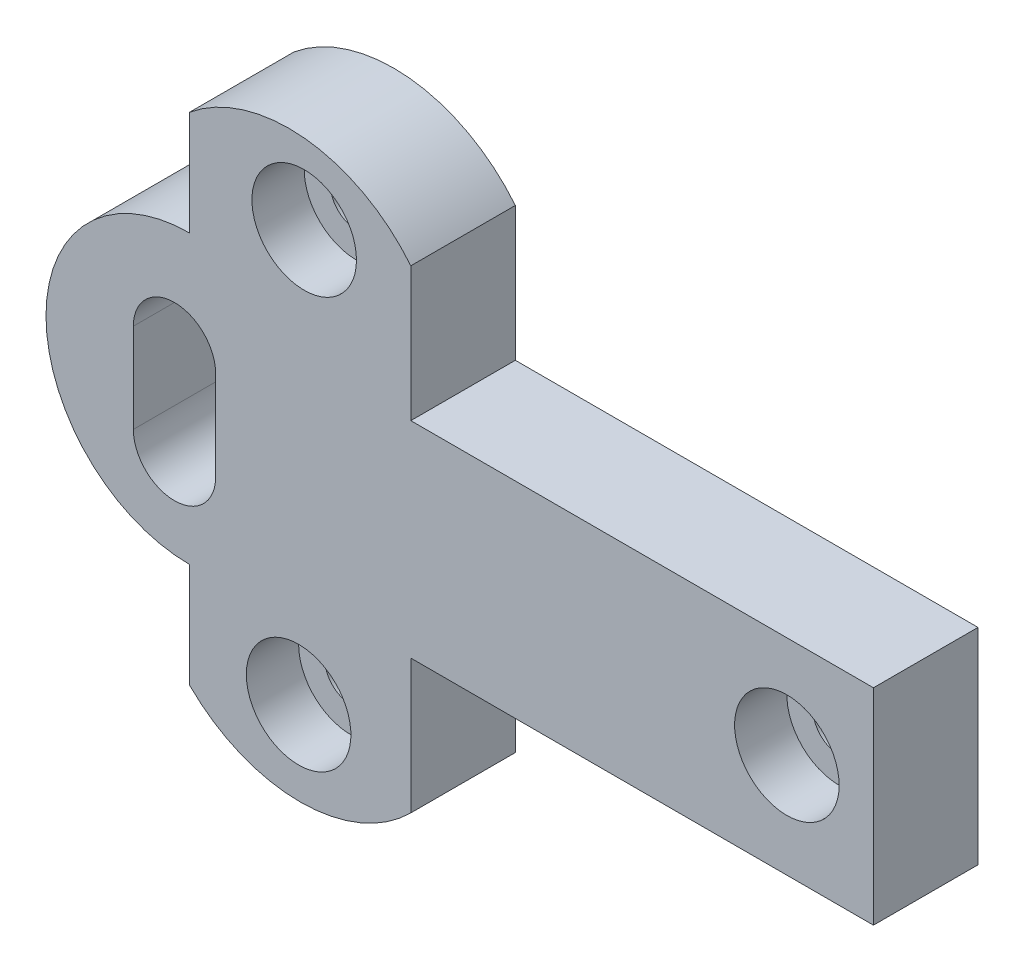
ISO-10303-21;
HEADER;
FILE_DESCRIPTION(('STEP AP214'),'2;1');
FILE_NAME('part.step','',(''),(''),'','','');
FILE_SCHEMA(('AUTOMOTIVE_DESIGN { 1 0 10303 214 1 1 1 1 }'));
ENDSEC;
DATA;
#1=APPLICATION_CONTEXT('core data for automotive mechanical design processes');
#2=APPLICATION_PROTOCOL_DEFINITION('international standard','automotive_design',2000,#1);
#3=PRODUCT_CONTEXT('',#1,'mechanical');
#4=PRODUCT('Part','Part','',(#3));
#5=PRODUCT_RELATED_PRODUCT_CATEGORY('part','',(#4));
#6=PRODUCT_DEFINITION_FORMATION('','',#4);
#7=PRODUCT_DEFINITION_CONTEXT('part definition',#1,'design');
#8=PRODUCT_DEFINITION('design','',#6,#7);
#9=PRODUCT_DEFINITION_SHAPE('','',#8);
#10=(LENGTH_UNIT() NAMED_UNIT(*) SI_UNIT(.MILLI.,.METRE.));
#11=(NAMED_UNIT(*) PLANE_ANGLE_UNIT() SI_UNIT($,.RADIAN.));
#12=(NAMED_UNIT(*) SI_UNIT($,.STERADIAN.) SOLID_ANGLE_UNIT());
#13=UNCERTAINTY_MEASURE_WITH_UNIT(LENGTH_MEASURE(1.E-05),#10,'distance_accuracy_value','');
#14=(GEOMETRIC_REPRESENTATION_CONTEXT(3) GLOBAL_UNCERTAINTY_ASSIGNED_CONTEXT((#13)) GLOBAL_UNIT_ASSIGNED_CONTEXT((#10,
#11,#12)) REPRESENTATION_CONTEXT('',''));
#15=CARTESIAN_POINT('',(0.,0.,0.));
#16=DIRECTION('',(0.,0.,1.));
#17=DIRECTION('',(1.,0.,0.));
#18=AXIS2_PLACEMENT_3D('',#15,#16,#17);
#19=CARTESIAN_POINT('',(-63.4934408824434,-26.2952633957593,20.));
#20=DIRECTION('',(0.,0.,1.));
#21=DIRECTION('',(1.,0.,0.));
#22=AXIS2_PLACEMENT_3D('',#19,#20,#21);
#23=PLANE('',#22);
#24=CARTESIAN_POINT('',(-87.5365630246195,-10.4618676253859,20.));
#25=DIRECTION('',(0.,0.,1.));
#26=DIRECTION('',(1.,0.,0.));
#27=AXIS2_PLACEMENT_3D('',#24,#25,#26);
#28=CIRCLE('',#27,7.87544496243334);
#29=CARTESIAN_POINT('',(-95.4120079870528,-10.4618676253859,20.));
#30=VERTEX_POINT('',#29);
#31=CARTESIAN_POINT('',(-79.6611180621862,-10.4618676253859,20.));
#32=VERTEX_POINT('',#31);
#33=EDGE_CURVE('E54',#30,#32,#28,.T.);
#34=ORIENTED_EDGE('',*,*,#33,.F.);
#35=DIRECTION('',(0.,-1.,0.));
#36=VECTOR('',#35,1.);
#37=CARTESIAN_POINT('',(-95.4120079870528,-10.4618676253859,20.));
#38=LINE('',#37,#36);
#39=CARTESIAN_POINT('',(-95.4120079870528,6.63335664860856,20.));
#40=VERTEX_POINT('',#39);
#41=EDGE_CURVE('E158',#40,#30,#38,.T.);
#42=ORIENTED_EDGE('',*,*,#41,.F.);
#43=CARTESIAN_POINT('',(-87.5365630246195,6.63335664860856,20.));
#44=DIRECTION('',(0.,0.,1.));
#45=DIRECTION('',(1.,0.,0.));
#46=AXIS2_PLACEMENT_3D('',#43,#44,#45);
#47=CIRCLE('',#46,7.87544496243334);
#48=CARTESIAN_POINT('',(-79.6611180621862,6.63335664860856,20.));
#49=VERTEX_POINT('',#48);
#50=EDGE_CURVE('E161',#49,#40,#47,.T.);
#51=ORIENTED_EDGE('',*,*,#50,.F.);
#52=DIRECTION('',(0.,1.,0.));
#53=VECTOR('',#52,1.);
#54=CARTESIAN_POINT('',(-79.6611180621862,-10.4618676253859,20.));
#55=LINE('',#54,#53);
#56=EDGE_CURVE('E170',#32,#49,#55,.T.);
#57=ORIENTED_EDGE('',*,*,#56,.F.);
#58=EDGE_LOOP('',(#34,#42,#51,#57));
#59=FACE_BOUND('',#58,.T.);
#60=CARTESIAN_POINT('',(-63.7943137850185,-40.2511393195703,20.));
#61=DIRECTION('',(0.,0.,-1.));
#62=DIRECTION('',(-1.,0.,0.));
#63=AXIS2_PLACEMENT_3D('',#60,#61,#62);
#64=CIRCLE('',#63,10.);
#65=CARTESIAN_POINT('',(-73.7943137850185,-40.2511393195703,20.));
#66=VERTEX_POINT('',#65);
#67=EDGE_CURVE('E193',#66,#66,#64,.T.);
#68=ORIENTED_EDGE('',*,*,#67,.T.);
#69=EDGE_LOOP('',(#68));
#70=FACE_BOUND('',#69,.T.);
#71=DIRECTION('',(0.,1.,0.));
#72=VECTOR('',#71,1.);
#73=CARTESIAN_POINT('',(46.1770479145043,17.5301755971729,20.));
#74=LINE('',#73,#72);
#75=CARTESIAN_POINT('',(46.1770479145043,-21.8058281818492,20.));
#76=VERTEX_POINT('',#75);
#77=CARTESIAN_POINT('',(46.1770479145043,17.5301755971729,20.));
#78=VERTEX_POINT('',#77);
#79=EDGE_CURVE('E198',#76,#78,#74,.T.);
#80=ORIENTED_EDGE('',*,*,#79,.T.);
#81=DIRECTION('',(-1.,0.,0.));
#82=VECTOR('',#81,1.);
#83=CARTESIAN_POINT('',(46.1770479145043,17.5301755971729,20.));
#84=LINE('',#83,#82);
#85=CARTESIAN_POINT('',(-42.3289605882956,17.5301755971729,20.));
#86=VERTEX_POINT('',#85);
#87=EDGE_CURVE('E201',#78,#86,#84,.T.);
#88=ORIENTED_EDGE('',*,*,#87,.T.);
#89=DIRECTION('',(0.,1.,0.));
#90=VECTOR('',#89,1.);
#91=CARTESIAN_POINT('',(-42.3289605882956,17.5301755971729,20.));
#92=LINE('',#91,#90);
#93=CARTESIAN_POINT('',(-42.3289605882956,43.1840911052309,20.));
#94=VERTEX_POINT('',#93);
#95=EDGE_CURVE('E204',#86,#94,#92,.T.);
#96=ORIENTED_EDGE('',*,*,#95,.T.);
#97=CARTESIAN_POINT('',(-65.6106395340796,24.3736185511406,20.));
#98=DIRECTION('',(0.,0.,1.));
#99=DIRECTION('',(1.,0.,0.));
#100=AXIS2_PLACEMENT_3D('',#97,#98,#99);
#101=CIRCLE('',#100,29.931095072562);
#102=CARTESIAN_POINT('',(-84.660607585696,47.4597435935799,20.));
#103=VERTEX_POINT('',#102);
#104=EDGE_CURVE('E206',#94,#103,#101,.T.);
#105=ORIENTED_EDGE('',*,*,#104,.T.);
#106=DIRECTION('',(0.,-1.,0.));
#107=VECTOR('',#106,1.);
#108=CARTESIAN_POINT('',(-84.660607585696,47.4597435935799,20.));
#109=LINE('',#108,#107);
#110=CARTESIAN_POINT('',(-84.660607585696,27.4597435935799,20.));
#111=VERTEX_POINT('',#110);
#112=EDGE_CURVE('E208',#103,#111,#109,.T.);
#113=ORIENTED_EDGE('',*,*,#112,.T.);
#114=CARTESIAN_POINT('',(-84.6592643811436,-4.81636640289044E-08,20.));
#115=DIRECTION('',(0.,0.,1.));
#116=DIRECTION('',(-1.,0.,0.));
#117=AXIS2_PLACEMENT_3D('',#114,#115,#116);
#118=CIRCLE('',#117,27.4597436745952);
#119=CARTESIAN_POINT('',(-84.6579211765912,-27.4597436899072,20.));
#120=VERTEX_POINT('',#119);
#121=EDGE_CURVE('E210',#111,#120,#118,.T.);
#122=ORIENTED_EDGE('',*,*,#121,.T.);
#123=DIRECTION('',(0.,-1.,0.));
#124=VECTOR('',#123,1.);
#125=CARTESIAN_POINT('',(-84.6579211765912,-47.4597436899072,20.));
#126=LINE('',#125,#124);
#127=CARTESIAN_POINT('',(-84.6579211765912,-47.4597436899072,20.));
#128=VERTEX_POINT('',#127);
#129=EDGE_CURVE('E212',#120,#128,#126,.T.);
#130=ORIENTED_EDGE('',*,*,#129,.T.);
#131=CARTESIAN_POINT('',(-63.4934408824434,-26.2952633957593,20.));
#132=DIRECTION('',(0.,0.,1.));
#133=DIRECTION('',(1.,0.,0.));
#134=AXIS2_PLACEMENT_3D('',#131,#132,#133);
#135=CIRCLE('',#134,29.931095072562);
#136=CARTESIAN_POINT('',(-42.3289605882956,-47.4597436899072,20.));
#137=VERTEX_POINT('',#136);
#138=EDGE_CURVE('E214',#128,#137,#135,.T.);
#139=ORIENTED_EDGE('',*,*,#138,.T.);
#140=DIRECTION('',(0.,1.,0.));
#141=VECTOR('',#140,1.);
#142=CARTESIAN_POINT('',(-42.3289605882956,-47.4597436899072,20.));
#143=LINE('',#142,#141);
#144=CARTESIAN_POINT('',(-42.3289605882956,-21.8058281818492,20.));
#145=VERTEX_POINT('',#144);
#146=EDGE_CURVE('E216',#137,#145,#143,.T.);
#147=ORIENTED_EDGE('',*,*,#146,.T.);
#148=DIRECTION('',(1.,0.,0.));
#149=VECTOR('',#148,1.);
#150=CARTESIAN_POINT('',(-42.3289605882956,-21.8058281818492,20.));
#151=LINE('',#150,#149);
#152=EDGE_CURVE('E218',#145,#76,#151,.T.);
#153=ORIENTED_EDGE('',*,*,#152,.T.);
#154=EDGE_LOOP('',(#80,#88,#96,#105,#113,#122,#130,#139,#147,#153));
#155=FACE_BOUND('',#154,.T.);
#156=CARTESIAN_POINT('',(29.6122655915803,-1.91425548838866,20.));
#157=DIRECTION('',(0.,0.,1.));
#158=DIRECTION('',(1.,0.,0.));
#159=AXIS2_PLACEMENT_3D('',#156,#157,#158);
#160=CIRCLE('',#159,10.);
#161=CARTESIAN_POINT('',(39.6122655915803,-1.91425548838866,20.));
#162=VERTEX_POINT('',#161);
#163=EDGE_CURVE('E187',#162,#162,#160,.T.);
#164=ORIENTED_EDGE('',*,*,#163,.F.);
#165=EDGE_LOOP('',(#164));
#166=FACE_BOUND('',#165,.T.);
#167=CARTESIAN_POINT('',(-62.7256310923718,38.9295759761807,20.));
#168=DIRECTION('',(0.,0.,1.));
#169=DIRECTION('',(1.,0.,0.));
#170=AXIS2_PLACEMENT_3D('',#167,#168,#169);
#171=CIRCLE('',#170,10.);
#172=CARTESIAN_POINT('',(-52.7256310923717,38.9295759761807,20.));
#173=VERTEX_POINT('',#172);
#174=EDGE_CURVE('E184',#173,#173,#171,.T.);
#175=ORIENTED_EDGE('',*,*,#174,.F.);
#176=EDGE_LOOP('',(#175));
#177=FACE_BOUND('',#176,.T.);
#178=ADVANCED_FACE('F37',(#59,#70,#155,#166,#177),#23,.T.);
#179=CARTESIAN_POINT('',(46.1770479145043,17.5301755971729,20.));
#180=DIRECTION('',(-1.,0.,0.));
#181=DIRECTION('',(0.,-1.,0.));
#182=AXIS2_PLACEMENT_3D('',#179,#180,#181);
#183=PLANE('',#182);
#184=DIRECTION('',(0.,1.,0.));
#185=VECTOR('',#184,1.);
#186=CARTESIAN_POINT('',(46.1770479145043,17.5301755971729,0.));
#187=LINE('',#186,#185);
#188=CARTESIAN_POINT('',(46.1770479145043,-21.8058281818492,0.));
#189=VERTEX_POINT('',#188);
#190=CARTESIAN_POINT('',(46.1770479145043,17.5301755971729,0.));
#191=VERTEX_POINT('',#190);
#192=EDGE_CURVE('E183',#189,#191,#187,.T.);
#193=ORIENTED_EDGE('',*,*,#192,.T.);
#194=DIRECTION('',(0.,0.,-1.));
#195=VECTOR('',#194,1.);
#196=CARTESIAN_POINT('',(46.1770479145043,17.5301755971729,20.));
#197=LINE('',#196,#195);
#198=EDGE_CURVE('E11',#78,#191,#197,.T.);
#199=ORIENTED_EDGE('',*,*,#198,.F.);
#200=ORIENTED_EDGE('',*,*,#79,.F.);
#201=DIRECTION('',(0.,0.,-1.));
#202=VECTOR('',#201,1.);
#203=CARTESIAN_POINT('',(46.1770479145043,-21.8058281818492,20.));
#204=LINE('',#203,#202);
#205=EDGE_CURVE('E220',#76,#189,#204,.T.);
#206=ORIENTED_EDGE('',*,*,#205,.T.);
#207=EDGE_LOOP('',(#193,#199,#200,#206));
#208=FACE_BOUND('',#207,.T.);
#209=ADVANCED_FACE('F39',(#208),#183,.F.);
#210=CARTESIAN_POINT('',(46.1770479145043,17.5301755971729,20.));
#211=DIRECTION('',(0.,-1.,0.));
#212=DIRECTION('',(1.,0.,0.));
#213=AXIS2_PLACEMENT_3D('',#210,#211,#212);
#214=PLANE('',#213);
#215=DIRECTION('',(-1.,0.,0.));
#216=VECTOR('',#215,1.);
#217=CARTESIAN_POINT('',(46.1770479145043,17.5301755971729,0.));
#218=LINE('',#217,#216);
#219=CARTESIAN_POINT('',(-42.3289605882956,17.5301755971729,0.));
#220=VERTEX_POINT('',#219);
#221=EDGE_CURVE('E223',#191,#220,#218,.T.);
#222=ORIENTED_EDGE('',*,*,#221,.T.);
#223=DIRECTION('',(0.,0.,-1.));
#224=VECTOR('',#223,1.);
#225=CARTESIAN_POINT('',(-42.3289605882956,17.5301755971729,20.));
#226=LINE('',#225,#224);
#227=EDGE_CURVE('E46',#86,#220,#226,.T.);
#228=ORIENTED_EDGE('',*,*,#227,.F.);
#229=ORIENTED_EDGE('',*,*,#87,.F.);
#230=ORIENTED_EDGE('',*,*,#198,.T.);
#231=EDGE_LOOP('',(#222,#228,#229,#230));
#232=FACE_BOUND('',#231,.T.);
#233=ADVANCED_FACE('F296',(#232),#214,.F.);
#234=CARTESIAN_POINT('',(-42.3289605882956,17.5301755971729,20.));
#235=DIRECTION('',(-1.,0.,0.));
#236=DIRECTION('',(0.,-1.,0.));
#237=AXIS2_PLACEMENT_3D('',#234,#235,#236);
#238=PLANE('',#237);
#239=DIRECTION('',(0.,1.,0.));
#240=VECTOR('',#239,1.);
#241=CARTESIAN_POINT('',(-42.3289605882956,17.5301755971729,0.));
#242=LINE('',#241,#240);
#243=CARTESIAN_POINT('',(-42.3289605882956,43.1840911052309,0.));
#244=VERTEX_POINT('',#243);
#245=EDGE_CURVE('E225',#220,#244,#242,.T.);
#246=ORIENTED_EDGE('',*,*,#245,.T.);
#247=DIRECTION('',(0.,0.,-1.));
#248=VECTOR('',#247,1.);
#249=CARTESIAN_POINT('',(-42.3289605882956,43.1840911052309,20.));
#250=LINE('',#249,#248);
#251=EDGE_CURVE('E260',#94,#244,#250,.T.);
#252=ORIENTED_EDGE('',*,*,#251,.F.);
#253=ORIENTED_EDGE('',*,*,#95,.F.);
#254=ORIENTED_EDGE('',*,*,#227,.T.);
#255=EDGE_LOOP('',(#246,#252,#253,#254));
#256=FACE_BOUND('',#255,.T.);
#257=ADVANCED_FACE('F333',(#256),#238,.F.);
#258=CARTESIAN_POINT('',(-65.6106395340796,24.3736185511406,20.));
#259=DIRECTION('',(0.,0.,-1.));
#260=DIRECTION('',(-1.,0.,0.));
#261=AXIS2_PLACEMENT_3D('',#258,#259,#260);
#262=CYLINDRICAL_SURFACE('',#261,29.931095072562);
#263=CARTESIAN_POINT('',(-65.6106395340796,24.3736185511406,0.));
#264=DIRECTION('',(0.,0.,1.));
#265=DIRECTION('',(1.,0.,0.));
#266=AXIS2_PLACEMENT_3D('',#263,#264,#265);
#267=CIRCLE('',#266,29.931095072562);
#268=CARTESIAN_POINT('',(-84.660607585696,47.4597435935799,0.));
#269=VERTEX_POINT('',#268);
#270=EDGE_CURVE('E227',#244,#269,#267,.T.);
#271=ORIENTED_EDGE('',*,*,#270,.T.);
#272=DIRECTION('',(0.,0.,-1.));
#273=VECTOR('',#272,1.);
#274=CARTESIAN_POINT('',(-84.660607585696,47.4597435935799,20.));
#275=LINE('',#274,#273);
#276=EDGE_CURVE('E257',#103,#269,#275,.T.);
#277=ORIENTED_EDGE('',*,*,#276,.F.);
#278=ORIENTED_EDGE('',*,*,#104,.F.);
#279=ORIENTED_EDGE('',*,*,#251,.T.);
#280=EDGE_LOOP('',(#271,#277,#278,#279));
#281=FACE_BOUND('',#280,.T.);
#282=ADVANCED_FACE('F329',(#281),#262,.T.);
#283=CARTESIAN_POINT('',(-84.660607585696,47.4597435935799,20.));
#284=DIRECTION('',(1.,0.,0.));
#285=DIRECTION('',(0.,0.,-1.));
#286=AXIS2_PLACEMENT_3D('',#283,#284,#285);
#287=PLANE('',#286);
#288=DIRECTION('',(0.,-1.,0.));
#289=VECTOR('',#288,1.);
#290=CARTESIAN_POINT('',(-84.660607585696,47.4597435935799,0.));
#291=LINE('',#290,#289);
#292=CARTESIAN_POINT('',(-84.660607585696,27.4597435935799,0.));
#293=VERTEX_POINT('',#292);
#294=EDGE_CURVE('E229',#269,#293,#291,.T.);
#295=ORIENTED_EDGE('',*,*,#294,.T.);
#296=DIRECTION('',(0.,0.,-1.));
#297=VECTOR('',#296,1.);
#298=CARTESIAN_POINT('',(-84.660607585696,27.4597435935799,20.));
#299=LINE('',#298,#297);
#300=EDGE_CURVE('E254',#111,#293,#299,.T.);
#301=ORIENTED_EDGE('',*,*,#300,.F.);
#302=ORIENTED_EDGE('',*,*,#112,.F.);
#303=ORIENTED_EDGE('',*,*,#276,.T.);
#304=EDGE_LOOP('',(#295,#301,#302,#303));
#305=FACE_BOUND('',#304,.T.);
#306=ADVANCED_FACE('F325',(#305),#287,.F.);
#307=CARTESIAN_POINT('',(-84.6592643811436,-4.81636640289044E-08,20.));
#308=DIRECTION('',(0.,0.,-1.));
#309=DIRECTION('',(-1.,0.,0.));
#310=AXIS2_PLACEMENT_3D('',#307,#308,#309);
#311=CYLINDRICAL_SURFACE('',#310,27.4597436745952);
#312=CARTESIAN_POINT('',(-84.6592643811436,-4.81636640289044E-08,0.));
#313=DIRECTION('',(0.,0.,1.));
#314=DIRECTION('',(-1.,0.,0.));
#315=AXIS2_PLACEMENT_3D('',#312,#313,#314);
#316=CIRCLE('',#315,27.4597436745952);
#317=CARTESIAN_POINT('',(-84.6579211765912,-27.4597436899072,0.));
#318=VERTEX_POINT('',#317);
#319=EDGE_CURVE('E231',#293,#318,#316,.T.);
#320=ORIENTED_EDGE('',*,*,#319,.T.);
#321=DIRECTION('',(0.,0.,-1.));
#322=VECTOR('',#321,1.);
#323=CARTESIAN_POINT('',(-84.6579211765912,-27.4597436899072,20.));
#324=LINE('',#323,#322);
#325=EDGE_CURVE('E251',#120,#318,#324,.T.);
#326=ORIENTED_EDGE('',*,*,#325,.F.);
#327=ORIENTED_EDGE('',*,*,#121,.F.);
#328=ORIENTED_EDGE('',*,*,#300,.T.);
#329=EDGE_LOOP('',(#320,#326,#327,#328));
#330=FACE_BOUND('',#329,.T.);
#331=ADVANCED_FACE('F321',(#330),#311,.T.);
#332=CARTESIAN_POINT('',(-84.6579211765912,-47.4597436899072,20.));
#333=DIRECTION('',(1.,0.,0.));
#334=DIRECTION('',(0.,0.,-1.));
#335=AXIS2_PLACEMENT_3D('',#332,#333,#334);
#336=PLANE('',#335);
#337=DIRECTION('',(0.,-1.,0.));
#338=VECTOR('',#337,1.);
#339=CARTESIAN_POINT('',(-84.6579211765912,-47.4597436899072,0.));
#340=LINE('',#339,#338);
#341=CARTESIAN_POINT('',(-84.6579211765912,-47.4597436899072,0.));
#342=VERTEX_POINT('',#341);
#343=EDGE_CURVE('E233',#318,#342,#340,.T.);
#344=ORIENTED_EDGE('',*,*,#343,.T.);
#345=DIRECTION('',(0.,0.,-1.));
#346=VECTOR('',#345,1.);
#347=CARTESIAN_POINT('',(-84.6579211765912,-47.4597436899072,20.));
#348=LINE('',#347,#346);
#349=EDGE_CURVE('E248',#128,#342,#348,.T.);
#350=ORIENTED_EDGE('',*,*,#349,.F.);
#351=ORIENTED_EDGE('',*,*,#129,.F.);
#352=ORIENTED_EDGE('',*,*,#325,.T.);
#353=EDGE_LOOP('',(#344,#350,#351,#352));
#354=FACE_BOUND('',#353,.T.);
#355=ADVANCED_FACE('F317',(#354),#336,.F.);
#356=CARTESIAN_POINT('',(-63.4934408824434,-26.2952633957593,20.));
#357=DIRECTION('',(0.,0.,-1.));
#358=DIRECTION('',(-1.,0.,0.));
#359=AXIS2_PLACEMENT_3D('',#356,#357,#358);
#360=CYLINDRICAL_SURFACE('',#359,29.931095072562);
#361=CARTESIAN_POINT('',(-63.4934408824434,-26.2952633957593,0.));
#362=DIRECTION('',(0.,0.,1.));
#363=DIRECTION('',(1.,0.,0.));
#364=AXIS2_PLACEMENT_3D('',#361,#362,#363);
#365=CIRCLE('',#364,29.931095072562);
#366=CARTESIAN_POINT('',(-42.3289605882956,-47.4597436899072,0.));
#367=VERTEX_POINT('',#366);
#368=EDGE_CURVE('E235',#342,#367,#365,.T.);
#369=ORIENTED_EDGE('',*,*,#368,.T.);
#370=DIRECTION('',(0.,0.,-1.));
#371=VECTOR('',#370,1.);
#372=CARTESIAN_POINT('',(-42.3289605882956,-47.4597436899072,20.));
#373=LINE('',#372,#371);
#374=EDGE_CURVE('E245',#137,#367,#373,.T.);
#375=ORIENTED_EDGE('',*,*,#374,.F.);
#376=ORIENTED_EDGE('',*,*,#138,.F.);
#377=ORIENTED_EDGE('',*,*,#349,.T.);
#378=EDGE_LOOP('',(#369,#375,#376,#377));
#379=FACE_BOUND('',#378,.T.);
#380=ADVANCED_FACE('F313',(#379),#360,.T.);
#381=CARTESIAN_POINT('',(-42.3289605882956,-47.4597436899072,20.));
#382=DIRECTION('',(-1.,0.,0.));
#383=DIRECTION('',(0.,0.,1.));
#384=AXIS2_PLACEMENT_3D('',#381,#382,#383);
#385=PLANE('',#384);
#386=DIRECTION('',(0.,1.,0.));
#387=VECTOR('',#386,1.);
#388=CARTESIAN_POINT('',(-42.3289605882956,-47.4597436899072,0.));
#389=LINE('',#388,#387);
#390=CARTESIAN_POINT('',(-42.3289605882956,-21.8058281818492,0.));
#391=VERTEX_POINT('',#390);
#392=EDGE_CURVE('E237',#367,#391,#389,.T.);
#393=ORIENTED_EDGE('',*,*,#392,.T.);
#394=DIRECTION('',(0.,0.,-1.));
#395=VECTOR('',#394,1.);
#396=CARTESIAN_POINT('',(-42.3289605882956,-21.8058281818492,20.));
#397=LINE('',#396,#395);
#398=EDGE_CURVE('E242',#145,#391,#397,.T.);
#399=ORIENTED_EDGE('',*,*,#398,.F.);
#400=ORIENTED_EDGE('',*,*,#146,.F.);
#401=ORIENTED_EDGE('',*,*,#374,.T.);
#402=EDGE_LOOP('',(#393,#399,#400,#401));
#403=FACE_BOUND('',#402,.T.);
#404=ADVANCED_FACE('F309',(#403),#385,.F.);
#405=CARTESIAN_POINT('',(-42.3289605882956,-21.8058281818492,20.));
#406=DIRECTION('',(0.,1.,0.));
#407=DIRECTION('',(0.,0.,1.));
#408=AXIS2_PLACEMENT_3D('',#405,#406,#407);
#409=PLANE('',#408);
#410=DIRECTION('',(1.,0.,0.));
#411=VECTOR('',#410,1.);
#412=CARTESIAN_POINT('',(-42.3289605882956,-21.8058281818492,0.));
#413=LINE('',#412,#411);
#414=EDGE_CURVE('E202',#391,#189,#413,.T.);
#415=ORIENTED_EDGE('',*,*,#414,.T.);
#416=ORIENTED_EDGE('',*,*,#205,.F.);
#417=ORIENTED_EDGE('',*,*,#152,.F.);
#418=ORIENTED_EDGE('',*,*,#398,.T.);
#419=EDGE_LOOP('',(#415,#416,#417,#418));
#420=FACE_BOUND('',#419,.T.);
#421=ADVANCED_FACE('F305',(#420),#409,.F.);
#422=CARTESIAN_POINT('',(-63.4934408824434,-26.2952633957593,0.));
#423=DIRECTION('',(0.,0.,1.));
#424=DIRECTION('',(1.,0.,0.));
#425=AXIS2_PLACEMENT_3D('',#422,#423,#424);
#426=PLANE('',#425);
#427=CARTESIAN_POINT('',(-62.7256310923718,38.9295759761807,0.));
#428=DIRECTION('',(0.,0.,1.));
#429=DIRECTION('',(1.,0.,0.));
#430=AXIS2_PLACEMENT_3D('',#427,#428,#429);
#431=CIRCLE('',#430,5.);
#432=CARTESIAN_POINT('',(-57.7256310923718,38.9295759761807,0.));
#433=VERTEX_POINT('',#432);
#434=EDGE_CURVE('E268',#433,#433,#431,.T.);
#435=ORIENTED_EDGE('',*,*,#434,.T.);
#436=EDGE_LOOP('',(#435));
#437=FACE_BOUND('',#436,.T.);
#438=CARTESIAN_POINT('',(-63.7943137850185,-40.2511393195703,0.));
#439=DIRECTION('',(0.,0.,1.));
#440=DIRECTION('',(1.,0.,0.));
#441=AXIS2_PLACEMENT_3D('',#438,#439,#440);
#442=CIRCLE('',#441,5.);
#443=CARTESIAN_POINT('',(-58.7943137850185,-40.2511393195703,0.));
#444=VERTEX_POINT('',#443);
#445=EDGE_CURVE('E561',#444,#444,#442,.T.);
#446=ORIENTED_EDGE('',*,*,#445,.T.);
#447=EDGE_LOOP('',(#446));
#448=FACE_BOUND('',#447,.T.);
#449=CARTESIAN_POINT('',(29.6122655915803,-1.91425548838866,0.));
#450=DIRECTION('',(0.,0.,1.));
#451=DIRECTION('',(1.,0.,0.));
#452=AXIS2_PLACEMENT_3D('',#449,#450,#451);
#453=CIRCLE('',#452,5.);
#454=CARTESIAN_POINT('',(34.6122655915803,-1.91425548838866,0.));
#455=VERTEX_POINT('',#454);
#456=EDGE_CURVE('E164',#455,#455,#453,.T.);
#457=ORIENTED_EDGE('',*,*,#456,.T.);
#458=EDGE_LOOP('',(#457));
#459=FACE_BOUND('',#458,.T.);
#460=DIRECTION('',(0.,-1.,0.));
#461=VECTOR('',#460,1.);
#462=CARTESIAN_POINT('',(-95.4120079870528,-10.4618676253859,0.));
#463=LINE('',#462,#461);
#464=CARTESIAN_POINT('',(-95.4120079870528,6.63335664860856,0.));
#465=VERTEX_POINT('',#464);
#466=CARTESIAN_POINT('',(-95.4120079870528,-10.4618676253859,0.));
#467=VERTEX_POINT('',#466);
#468=EDGE_CURVE('E148',#465,#467,#463,.T.);
#469=ORIENTED_EDGE('',*,*,#468,.T.);
#470=CARTESIAN_POINT('',(-87.5365630246195,-10.4618676253859,0.));
#471=DIRECTION('',(0.,0.,1.));
#472=DIRECTION('',(1.,0.,0.));
#473=AXIS2_PLACEMENT_3D('',#470,#471,#472);
#474=CIRCLE('',#473,7.87544496243334);
#475=CARTESIAN_POINT('',(-79.6611180621862,-10.4618676253859,0.));
#476=VERTEX_POINT('',#475);
#477=EDGE_CURVE('E142',#467,#476,#474,.T.);
#478=ORIENTED_EDGE('',*,*,#477,.T.);
#479=DIRECTION('',(0.,1.,0.));
#480=VECTOR('',#479,1.);
#481=CARTESIAN_POINT('',(-79.6611180621862,-10.4618676253859,0.));
#482=LINE('',#481,#480);
#483=CARTESIAN_POINT('',(-79.6611180621862,6.63335664860856,0.));
#484=VERTEX_POINT('',#483);
#485=EDGE_CURVE('E151',#476,#484,#482,.T.);
#486=ORIENTED_EDGE('',*,*,#485,.T.);
#487=CARTESIAN_POINT('',(-87.5365630246195,6.63335664860856,0.));
#488=DIRECTION('',(0.,0.,1.));
#489=DIRECTION('',(1.,0.,0.));
#490=AXIS2_PLACEMENT_3D('',#487,#488,#489);
#491=CIRCLE('',#490,7.87544496243334);
#492=EDGE_CURVE('E62',#484,#465,#491,.T.);
#493=ORIENTED_EDGE('',*,*,#492,.T.);
#494=EDGE_LOOP('',(#469,#478,#486,#493));
#495=FACE_BOUND('',#494,.T.);
#496=ORIENTED_EDGE('',*,*,#192,.F.);
#497=ORIENTED_EDGE('',*,*,#414,.F.);
#498=ORIENTED_EDGE('',*,*,#392,.F.);
#499=ORIENTED_EDGE('',*,*,#368,.F.);
#500=ORIENTED_EDGE('',*,*,#343,.F.);
#501=ORIENTED_EDGE('',*,*,#319,.F.);
#502=ORIENTED_EDGE('',*,*,#294,.F.);
#503=ORIENTED_EDGE('',*,*,#270,.F.);
#504=ORIENTED_EDGE('',*,*,#245,.F.);
#505=ORIENTED_EDGE('',*,*,#221,.F.);
#506=EDGE_LOOP('',(#496,#497,#498,#499,#500,#501,#502,#503,#504,#505));
#507=FACE_BOUND('',#506,.T.);
#508=ADVANCED_FACE('F155',(#437,#448,#459,#495,#507),#426,.F.);
#509=CARTESIAN_POINT('',(-63.7943137850185,-40.2511393195703,10.));
#510=DIRECTION('',(0.,0.,1.));
#511=DIRECTION('',(1.,0.,0.));
#512=AXIS2_PLACEMENT_3D('',#509,#510,#511);
#513=CYLINDRICAL_SURFACE('',#512,10.);
#514=CARTESIAN_POINT('',(-63.7943137850185,-40.2511393195703,10.));
#515=DIRECTION('',(0.,0.,-1.));
#516=DIRECTION('',(-1.,0.,0.));
#517=AXIS2_PLACEMENT_3D('',#514,#515,#516);
#518=CIRCLE('',#517,10.);
#519=CARTESIAN_POINT('',(-73.7943137850185,-40.2511393195703,10.));
#520=VERTEX_POINT('',#519);
#521=EDGE_CURVE('E176',#520,#520,#518,.T.);
#522=ORIENTED_EDGE('',*,*,#521,.T.);
#523=EDGE_LOOP('',(#522));
#524=FACE_BOUND('',#523,.T.);
#525=ORIENTED_EDGE('',*,*,#67,.F.);
#526=EDGE_LOOP('',(#525));
#527=FACE_BOUND('',#526,.T.);
#528=ADVANCED_FACE('F304',(#524,#527),#513,.F.);
#529=CARTESIAN_POINT('',(-63.7943137850185,-40.2511393195703,10.));
#530=DIRECTION('',(0.,0.,-1.));
#531=DIRECTION('',(-1.,0.,0.));
#532=AXIS2_PLACEMENT_3D('',#529,#530,#531);
#533=PLANE('',#532);
#534=CARTESIAN_POINT('',(-63.7943137850185,-40.2511393195703,10.));
#535=DIRECTION('',(0.,0.,-1.));
#536=DIRECTION('',(-1.,0.,0.));
#537=AXIS2_PLACEMENT_3D('',#534,#535,#536);
#538=CIRCLE('',#537,5.);
#539=CARTESIAN_POINT('',(-68.7943137850184,-40.2511393195703,10.));
#540=VERTEX_POINT('',#539);
#541=EDGE_CURVE('E41',#540,#540,#538,.T.);
#542=ORIENTED_EDGE('',*,*,#541,.T.);
#543=EDGE_LOOP('',(#542));
#544=FACE_BOUND('',#543,.T.);
#545=ORIENTED_EDGE('',*,*,#521,.F.);
#546=EDGE_LOOP('',(#545));
#547=FACE_BOUND('',#546,.T.);
#548=ADVANCED_FACE('F275',(#544,#547),#533,.F.);
#549=CARTESIAN_POINT('',(29.6122655915803,-1.91425548838866,10.));
#550=DIRECTION('',(0.,0.,1.));
#551=DIRECTION('',(1.,0.,0.));
#552=AXIS2_PLACEMENT_3D('',#549,#550,#551);
#553=CYLINDRICAL_SURFACE('',#552,10.);
#554=CARTESIAN_POINT('',(29.6122655915803,-1.91425548838866,10.));
#555=DIRECTION('',(0.,0.,1.));
#556=DIRECTION('',(1.,0.,0.));
#557=AXIS2_PLACEMENT_3D('',#554,#555,#556);
#558=CIRCLE('',#557,10.);
#559=CARTESIAN_POINT('',(39.6122655915803,-1.91425548838866,10.));
#560=VERTEX_POINT('',#559);
#561=EDGE_CURVE('E190',#560,#560,#558,.T.);
#562=ORIENTED_EDGE('',*,*,#561,.F.);
#563=EDGE_LOOP('',(#562));
#564=FACE_BOUND('',#563,.T.);
#565=ORIENTED_EDGE('',*,*,#163,.T.);
#566=EDGE_LOOP('',(#565));
#567=FACE_BOUND('',#566,.T.);
#568=ADVANCED_FACE('F387',(#564,#567),#553,.F.);
#569=CARTESIAN_POINT('',(29.6122655915803,-1.91425548838866,10.));
#570=DIRECTION('',(0.,0.,1.));
#571=DIRECTION('',(1.,0.,0.));
#572=AXIS2_PLACEMENT_3D('',#569,#570,#571);
#573=PLANE('',#572);
#574=CARTESIAN_POINT('',(29.6122655915803,-1.91425548838866,10.));
#575=DIRECTION('',(0.,0.,1.));
#576=DIRECTION('',(1.,0.,0.));
#577=AXIS2_PLACEMENT_3D('',#574,#575,#576);
#578=CIRCLE('',#577,5.);
#579=CARTESIAN_POINT('',(34.6122655915803,-1.91425548838866,10.));
#580=VERTEX_POINT('',#579);
#581=EDGE_CURVE('E267',#580,#580,#578,.T.);
#582=ORIENTED_EDGE('',*,*,#581,.F.);
#583=EDGE_LOOP('',(#582));
#584=FACE_BOUND('',#583,.T.);
#585=ORIENTED_EDGE('',*,*,#561,.T.);
#586=EDGE_LOOP('',(#585));
#587=FACE_BOUND('',#586,.T.);
#588=ADVANCED_FACE('F378',(#584,#587),#573,.T.);
#589=CARTESIAN_POINT('',(-62.7256310923718,38.9295759761807,10.));
#590=DIRECTION('',(0.,0.,1.));
#591=DIRECTION('',(1.,0.,0.));
#592=AXIS2_PLACEMENT_3D('',#589,#590,#591);
#593=CYLINDRICAL_SURFACE('',#592,10.);
#594=CARTESIAN_POINT('',(-62.7256310923718,38.9295759761807,10.));
#595=DIRECTION('',(0.,0.,1.));
#596=DIRECTION('',(1.,0.,0.));
#597=AXIS2_PLACEMENT_3D('',#594,#595,#596);
#598=CIRCLE('',#597,10.);
#599=CARTESIAN_POINT('',(-52.7256310923717,38.9295759761807,10.));
#600=VERTEX_POINT('',#599);
#601=EDGE_CURVE('E180',#600,#600,#598,.T.);
#602=ORIENTED_EDGE('',*,*,#601,.F.);
#603=EDGE_LOOP('',(#602));
#604=FACE_BOUND('',#603,.T.);
#605=ORIENTED_EDGE('',*,*,#174,.T.);
#606=EDGE_LOOP('',(#605));
#607=FACE_BOUND('',#606,.T.);
#608=ADVANCED_FACE('F375',(#604,#607),#593,.F.);
#609=CARTESIAN_POINT('',(-62.7256310923718,38.9295759761807,10.));
#610=DIRECTION('',(0.,0.,1.));
#611=DIRECTION('',(1.,0.,0.));
#612=AXIS2_PLACEMENT_3D('',#609,#610,#611);
#613=PLANE('',#612);
#614=CARTESIAN_POINT('',(-62.7256310923718,38.9295759761807,10.));
#615=DIRECTION('',(0.,0.,1.));
#616=DIRECTION('',(1.,0.,0.));
#617=AXIS2_PLACEMENT_3D('',#614,#615,#616);
#618=CIRCLE('',#617,5.);
#619=CARTESIAN_POINT('',(-57.7256310923718,38.9295759761807,10.));
#620=VERTEX_POINT('',#619);
#621=EDGE_CURVE('E265',#620,#620,#618,.T.);
#622=ORIENTED_EDGE('',*,*,#621,.F.);
#623=EDGE_LOOP('',(#622));
#624=FACE_BOUND('',#623,.T.);
#625=ORIENTED_EDGE('',*,*,#601,.T.);
#626=EDGE_LOOP('',(#625));
#627=FACE_BOUND('',#626,.T.);
#628=ADVANCED_FACE('F377',(#624,#627),#613,.T.);
#629=CARTESIAN_POINT('',(-87.5365630246195,-10.4618676253859,0.));
#630=DIRECTION('',(0.,0.,1.));
#631=DIRECTION('',(1.,0.,0.));
#632=AXIS2_PLACEMENT_3D('',#629,#630,#631);
#633=CYLINDRICAL_SURFACE('',#632,7.87544496243334);
#634=ORIENTED_EDGE('',*,*,#33,.T.);
#635=DIRECTION('',(0.,0.,1.));
#636=VECTOR('',#635,1.);
#637=CARTESIAN_POINT('',(-79.6611180621862,-10.4618676253859,0.));
#638=LINE('',#637,#636);
#639=EDGE_CURVE('E138',#476,#32,#638,.T.);
#640=ORIENTED_EDGE('',*,*,#639,.F.);
#641=ORIENTED_EDGE('',*,*,#477,.F.);
#642=DIRECTION('',(0.,0.,1.));
#643=VECTOR('',#642,1.);
#644=CARTESIAN_POINT('',(-95.4120079870528,-10.4618676253859,0.));
#645=LINE('',#644,#643);
#646=EDGE_CURVE('E174',#467,#30,#645,.T.);
#647=ORIENTED_EDGE('',*,*,#646,.T.);
#648=EDGE_LOOP('',(#634,#640,#641,#647));
#649=FACE_BOUND('',#648,.T.);
#650=ADVANCED_FACE('F140',(#649),#633,.F.);
#651=CARTESIAN_POINT('',(-95.4120079870528,-10.4618676253859,0.));
#652=DIRECTION('',(-1.,0.,0.));
#653=DIRECTION('',(0.,0.,1.));
#654=AXIS2_PLACEMENT_3D('',#651,#652,#653);
#655=PLANE('',#654);
#656=ORIENTED_EDGE('',*,*,#41,.T.);
#657=ORIENTED_EDGE('',*,*,#646,.F.);
#658=ORIENTED_EDGE('',*,*,#468,.F.);
#659=DIRECTION('',(0.,0.,1.));
#660=VECTOR('',#659,1.);
#661=CARTESIAN_POINT('',(-95.4120079870528,6.63335664860856,0.));
#662=LINE('',#661,#660);
#663=EDGE_CURVE('E177',#465,#40,#662,.T.);
#664=ORIENTED_EDGE('',*,*,#663,.T.);
#665=EDGE_LOOP('',(#656,#657,#658,#664));
#666=FACE_BOUND('',#665,.T.);
#667=ADVANCED_FACE('F456',(#666),#655,.F.);
#668=CARTESIAN_POINT('',(-87.5365630246195,6.63335664860856,0.));
#669=DIRECTION('',(0.,0.,1.));
#670=DIRECTION('',(1.,0.,0.));
#671=AXIS2_PLACEMENT_3D('',#668,#669,#670);
#672=CYLINDRICAL_SURFACE('',#671,7.87544496243334);
#673=ORIENTED_EDGE('',*,*,#50,.T.);
#674=ORIENTED_EDGE('',*,*,#663,.F.);
#675=ORIENTED_EDGE('',*,*,#492,.F.);
#676=DIRECTION('',(0.,0.,1.));
#677=VECTOR('',#676,1.);
#678=CARTESIAN_POINT('',(-79.6611180621862,6.63335664860856,0.));
#679=LINE('',#678,#677);
#680=EDGE_CURVE('E147',#484,#49,#679,.T.);
#681=ORIENTED_EDGE('',*,*,#680,.T.);
#682=EDGE_LOOP('',(#673,#674,#675,#681));
#683=FACE_BOUND('',#682,.T.);
#684=ADVANCED_FACE('F450',(#683),#672,.F.);
#685=CARTESIAN_POINT('',(-79.6611180621862,-10.4618676253859,0.));
#686=DIRECTION('',(1.,0.,0.));
#687=DIRECTION('',(0.,0.,-1.));
#688=AXIS2_PLACEMENT_3D('',#685,#686,#687);
#689=PLANE('',#688);
#690=ORIENTED_EDGE('',*,*,#56,.T.);
#691=ORIENTED_EDGE('',*,*,#680,.F.);
#692=ORIENTED_EDGE('',*,*,#485,.F.);
#693=ORIENTED_EDGE('',*,*,#639,.T.);
#694=EDGE_LOOP('',(#690,#691,#692,#693));
#695=FACE_BOUND('',#694,.T.);
#696=ADVANCED_FACE('F152',(#695),#689,.F.);
#697=CARTESIAN_POINT('',(-62.7256310923718,38.9295759761807,0.));
#698=DIRECTION('',(0.,0.,1.));
#699=DIRECTION('',(1.,0.,0.));
#700=AXIS2_PLACEMENT_3D('',#697,#698,#699);
#701=CYLINDRICAL_SURFACE('',#700,5.);
#702=ORIENTED_EDGE('',*,*,#621,.T.);
#703=EDGE_LOOP('',(#702));
#704=FACE_BOUND('',#703,.T.);
#705=ORIENTED_EDGE('',*,*,#434,.F.);
#706=EDGE_LOOP('',(#705));
#707=FACE_BOUND('',#706,.T.);
#708=ADVANCED_FACE('F286',(#704,#707),#701,.F.);
#709=CARTESIAN_POINT('',(29.6122655915803,-1.91425548838866,0.));
#710=DIRECTION('',(0.,0.,1.));
#711=DIRECTION('',(1.,0.,0.));
#712=AXIS2_PLACEMENT_3D('',#709,#710,#711);
#713=CYLINDRICAL_SURFACE('',#712,5.);
#714=ORIENTED_EDGE('',*,*,#581,.T.);
#715=EDGE_LOOP('',(#714));
#716=FACE_BOUND('',#715,.T.);
#717=ORIENTED_EDGE('',*,*,#456,.F.);
#718=EDGE_LOOP('',(#717));
#719=FACE_BOUND('',#718,.T.);
#720=ADVANCED_FACE('F280',(#716,#719),#713,.F.);
#721=CARTESIAN_POINT('',(-63.7943137850185,-40.2511393195703,0.));
#722=DIRECTION('',(0.,0.,1.));
#723=DIRECTION('',(1.,0.,0.));
#724=AXIS2_PLACEMENT_3D('',#721,#722,#723);
#725=CYLINDRICAL_SURFACE('',#724,5.);
#726=ORIENTED_EDGE('',*,*,#445,.F.);
#727=EDGE_LOOP('',(#726));
#728=FACE_BOUND('',#727,.T.);
#729=ORIENTED_EDGE('',*,*,#541,.F.);
#730=EDGE_LOOP('',(#729));
#731=FACE_BOUND('',#730,.T.);
#732=ADVANCED_FACE('F278',(#728,#731),#725,.F.);
#733=CLOSED_SHELL('',(#178,#209,#233,#257,#282,#306,#331,#355,#380,#404,#421,#508,#528,#548,
#568,#588,#608,#628,#650,#667,#684,#696,#708,#720,#732));
#734=MANIFOLD_SOLID_BREP('B2',#733);
#735=ADVANCED_BREP_SHAPE_REPRESENTATION('',(#18,#734),#14);
#736=SHAPE_DEFINITION_REPRESENTATION(#9,#735);
ENDSEC;
END-ISO-10303-21;
